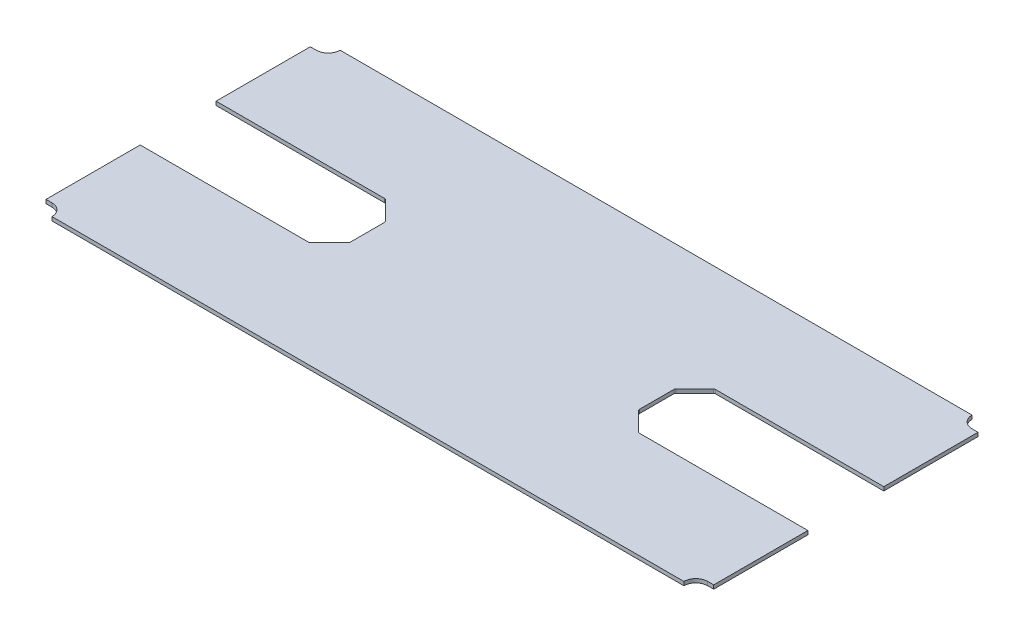
ISO-10303-21;
HEADER;
FILE_DESCRIPTION(('STEP AP214'),'2;1');
FILE_NAME('part.step','',(''),(''),'','','');
FILE_SCHEMA(('AUTOMOTIVE_DESIGN { 1 0 10303 214 1 1 1 1 }'));
ENDSEC;
DATA;
#1=APPLICATION_CONTEXT('core data for automotive mechanical design processes');
#2=APPLICATION_PROTOCOL_DEFINITION('international standard','automotive_design',2000,#1);
#3=PRODUCT_CONTEXT('',#1,'mechanical');
#4=PRODUCT('Part','Part','',(#3));
#5=PRODUCT_RELATED_PRODUCT_CATEGORY('part','',(#4));
#6=PRODUCT_DEFINITION_FORMATION('','',#4);
#7=PRODUCT_DEFINITION_CONTEXT('part definition',#1,'design');
#8=PRODUCT_DEFINITION('design','',#6,#7);
#9=PRODUCT_DEFINITION_SHAPE('','',#8);
#10=(LENGTH_UNIT() NAMED_UNIT(*) SI_UNIT(.MILLI.,.METRE.));
#11=(NAMED_UNIT(*) PLANE_ANGLE_UNIT() SI_UNIT($,.RADIAN.));
#12=(NAMED_UNIT(*) SI_UNIT($,.STERADIAN.) SOLID_ANGLE_UNIT());
#13=UNCERTAINTY_MEASURE_WITH_UNIT(LENGTH_MEASURE(1.E-05),#10,'distance_accuracy_value','');
#14=(GEOMETRIC_REPRESENTATION_CONTEXT(3) GLOBAL_UNCERTAINTY_ASSIGNED_CONTEXT((#13)) GLOBAL_UNIT_ASSIGNED_CONTEXT((#10,
#11,#12)) REPRESENTATION_CONTEXT('',''));
#15=CARTESIAN_POINT('',(0.,0.,0.));
#16=DIRECTION('',(0.,0.,1.));
#17=DIRECTION('',(1.,0.,0.));
#18=AXIS2_PLACEMENT_3D('',#15,#16,#17);
#19=CARTESIAN_POINT('',(825.,9.525,362.5));
#20=DIRECTION('',(0.,-1.,0.));
#21=DIRECTION('',(0.,0.,-1.));
#22=AXIS2_PLACEMENT_3D('',#19,#20,#21);
#23=CYLINDRICAL_SURFACE('',#22,30.);
#24=CARTESIAN_POINT('',(825.,0.,362.5));
#25=DIRECTION('',(0.,1.,0.));
#26=DIRECTION('',(0.,0.,1.));
#27=AXIS2_PLACEMENT_3D('',#24,#25,#26);
#28=CIRCLE('',#27,30.);
#29=CARTESIAN_POINT('',(825.,0.,332.5));
#30=VERTEX_POINT('',#29);
#31=CARTESIAN_POINT('',(795.,0.,362.5));
#32=VERTEX_POINT('',#31);
#33=EDGE_CURVE('E275',#30,#32,#28,.T.);
#34=ORIENTED_EDGE('',*,*,#33,.F.);
#35=DIRECTION('',(0.,-1.,0.));
#36=VECTOR('',#35,1.);
#37=CARTESIAN_POINT('',(825.,9.525,332.5));
#38=LINE('',#37,#36);
#39=CARTESIAN_POINT('',(825.,9.525,332.5));
#40=VERTEX_POINT('',#39);
#41=EDGE_CURVE('E271',#40,#30,#38,.T.);
#42=ORIENTED_EDGE('',*,*,#41,.F.);
#43=CARTESIAN_POINT('',(825.,9.525,362.5));
#44=DIRECTION('',(0.,1.,0.));
#45=DIRECTION('',(0.,0.,1.));
#46=AXIS2_PLACEMENT_3D('',#43,#44,#45);
#47=CIRCLE('',#46,30.);
#48=CARTESIAN_POINT('',(795.,9.525,362.5));
#49=VERTEX_POINT('',#48);
#50=EDGE_CURVE('E273',#40,#49,#47,.T.);
#51=ORIENTED_EDGE('',*,*,#50,.T.);
#52=DIRECTION('',(0.,-1.,0.));
#53=VECTOR('',#52,1.);
#54=CARTESIAN_POINT('',(795.,9.525,362.5));
#55=LINE('',#54,#53);
#56=EDGE_CURVE('E344',#49,#32,#55,.T.);
#57=ORIENTED_EDGE('',*,*,#56,.T.);
#58=EDGE_LOOP('',(#34,#42,#51,#57));
#59=FACE_BOUND('',#58,.T.);
#60=ADVANCED_FACE('F49',(#59),#23,.F.);
#61=CARTESIAN_POINT('',(0.,9.525,332.5));
#62=DIRECTION('',(0.,0.,1.));
#63=DIRECTION('',(1.,0.,0.));
#64=AXIS2_PLACEMENT_3D('',#61,#62,#63);
#65=PLANE('',#64);
#66=DIRECTION('',(-1.,0.,0.));
#67=VECTOR('',#66,1.);
#68=CARTESIAN_POINT('',(0.,0.,332.5));
#69=LINE('',#68,#67);
#70=CARTESIAN_POINT('',(840.,0.,332.5));
#71=VERTEX_POINT('',#70);
#72=EDGE_CURVE('E347',#71,#30,#69,.T.);
#73=ORIENTED_EDGE('',*,*,#72,.F.);
#74=DIRECTION('',(0.,-1.,0.));
#75=VECTOR('',#74,1.);
#76=CARTESIAN_POINT('',(840.,9.525,332.5));
#77=LINE('',#76,#75);
#78=CARTESIAN_POINT('',(840.,9.525,332.5));
#79=VERTEX_POINT('',#78);
#80=EDGE_CURVE('E282',#79,#71,#77,.T.);
#81=ORIENTED_EDGE('',*,*,#80,.F.);
#82=DIRECTION('',(-1.,0.,0.));
#83=VECTOR('',#82,1.);
#84=CARTESIAN_POINT('',(0.,9.525,332.5));
#85=LINE('',#84,#83);
#86=EDGE_CURVE('E288',#79,#40,#85,.T.);
#87=ORIENTED_EDGE('',*,*,#86,.T.);
#88=ORIENTED_EDGE('',*,*,#41,.T.);
#89=EDGE_LOOP('',(#73,#81,#87,#88));
#90=FACE_BOUND('',#89,.T.);
#91=ADVANCED_FACE('F296',(#90),#65,.T.);
#92=CARTESIAN_POINT('',(840.,9.525,0.));
#93=DIRECTION('',(1.,0.,0.));
#94=DIRECTION('',(0.,0.,-1.));
#95=AXIS2_PLACEMENT_3D('',#92,#93,#94);
#96=PLANE('',#95);
#97=DIRECTION('',(0.,0.,1.));
#98=VECTOR('',#97,1.);
#99=CARTESIAN_POINT('',(840.,0.,0.));
#100=LINE('',#99,#98);
#101=CARTESIAN_POINT('',(840.,0.,95.5));
#102=VERTEX_POINT('',#101);
#103=EDGE_CURVE('E350',#102,#71,#100,.T.);
#104=ORIENTED_EDGE('',*,*,#103,.F.);
#105=DIRECTION('',(0.,-1.,0.));
#106=VECTOR('',#105,1.);
#107=CARTESIAN_POINT('',(840.,9.525,95.5));
#108=LINE('',#107,#106);
#109=CARTESIAN_POINT('',(840.,9.525,95.5));
#110=VERTEX_POINT('',#109);
#111=EDGE_CURVE('E430',#110,#102,#108,.T.);
#112=ORIENTED_EDGE('',*,*,#111,.F.);
#113=DIRECTION('',(0.,0.,1.));
#114=VECTOR('',#113,1.);
#115=CARTESIAN_POINT('',(840.,9.525,0.));
#116=LINE('',#115,#114);
#117=EDGE_CURVE('E298',#110,#79,#116,.T.);
#118=ORIENTED_EDGE('',*,*,#117,.T.);
#119=ORIENTED_EDGE('',*,*,#80,.T.);
#120=EDGE_LOOP('',(#104,#112,#118,#119));
#121=FACE_BOUND('',#120,.T.);
#122=ADVANCED_FACE('F616',(#121),#96,.T.);
#123=CARTESIAN_POINT('',(0.,9.525,95.5));
#124=DIRECTION('',(0.,0.,-1.));
#125=DIRECTION('',(-1.,0.,0.));
#126=AXIS2_PLACEMENT_3D('',#123,#124,#125);
#127=PLANE('',#126);
#128=DIRECTION('',(1.,0.,0.));
#129=VECTOR('',#128,1.);
#130=CARTESIAN_POINT('',(0.,0.,95.5));
#131=LINE('',#130,#129);
#132=CARTESIAN_POINT('',(416.071067811866,0.,95.5));
#133=VERTEX_POINT('',#132);
#134=EDGE_CURVE('E354',#133,#102,#131,.T.);
#135=ORIENTED_EDGE('',*,*,#134,.F.);
#136=DIRECTION('',(0.,-1.,0.));
#137=VECTOR('',#136,1.);
#138=CARTESIAN_POINT('',(416.071067811866,9.525,95.5));
#139=LINE('',#138,#137);
#140=CARTESIAN_POINT('',(416.071067811866,9.525,95.5));
#141=VERTEX_POINT('',#140);
#142=EDGE_CURVE('E474',#133,#141,#139,.F.);
#143=ORIENTED_EDGE('',*,*,#142,.T.);
#144=DIRECTION('',(1.,0.,0.));
#145=VECTOR('',#144,1.);
#146=CARTESIAN_POINT('',(0.,9.525,95.5));
#147=LINE('',#146,#145);
#148=EDGE_CURVE('E301',#141,#110,#147,.T.);
#149=ORIENTED_EDGE('',*,*,#148,.T.);
#150=ORIENTED_EDGE('',*,*,#111,.T.);
#151=EDGE_LOOP('',(#135,#143,#149,#150));
#152=FACE_BOUND('',#151,.T.);
#153=ADVANCED_FACE('F611',(#152),#127,.T.);
#154=CARTESIAN_POINT('',(364.,9.525,0.));
#155=DIRECTION('',(1.,0.,0.));
#156=DIRECTION('',(0.,0.,-1.));
#157=AXIS2_PLACEMENT_3D('',#154,#155,#156);
#158=PLANE('',#157);
#159=DIRECTION('',(0.,0.,1.));
#160=VECTOR('',#159,1.);
#161=CARTESIAN_POINT('',(364.,0.,0.));
#162=LINE('',#161,#160);
#163=CARTESIAN_POINT('',(364.,0.,-43.4289321881347));
#164=VERTEX_POINT('',#163);
#165=CARTESIAN_POINT('',(364.,0.,43.4289321881341));
#166=VERTEX_POINT('',#165);
#167=EDGE_CURVE('E358',#164,#166,#162,.T.);
#168=ORIENTED_EDGE('',*,*,#167,.F.);
#169=DIRECTION('',(0.,-1.,0.));
#170=VECTOR('',#169,1.);
#171=CARTESIAN_POINT('',(364.,9.525,-43.4289321881347));
#172=LINE('',#171,#170);
#173=CARTESIAN_POINT('',(364.,9.525,-43.4289321881347));
#174=VERTEX_POINT('',#173);
#175=EDGE_CURVE('E463',#164,#174,#172,.F.);
#176=ORIENTED_EDGE('',*,*,#175,.T.);
#177=DIRECTION('',(0.,0.,1.));
#178=VECTOR('',#177,1.);
#179=CARTESIAN_POINT('',(364.,9.525,0.));
#180=LINE('',#179,#178);
#181=CARTESIAN_POINT('',(364.,9.525,43.4289321881341));
#182=VERTEX_POINT('',#181);
#183=EDGE_CURVE('E307',#174,#182,#180,.T.);
#184=ORIENTED_EDGE('',*,*,#183,.T.);
#185=DIRECTION('',(0.,1.,0.));
#186=VECTOR('',#185,1.);
#187=CARTESIAN_POINT('',(364.,9.525,43.4289321881341));
#188=LINE('',#187,#186);
#189=EDGE_CURVE('E460',#182,#166,#188,.F.);
#190=ORIENTED_EDGE('',*,*,#189,.T.);
#191=EDGE_LOOP('',(#168,#176,#184,#190));
#192=FACE_BOUND('',#191,.T.);
#193=ADVANCED_FACE('F594',(#192),#158,.T.);
#194=CARTESIAN_POINT('',(0.,9.525,-95.5));
#195=DIRECTION('',(0.,0.,1.));
#196=DIRECTION('',(1.,0.,0.));
#197=AXIS2_PLACEMENT_3D('',#194,#195,#196);
#198=PLANE('',#197);
#199=DIRECTION('',(-1.,0.,0.));
#200=VECTOR('',#199,1.);
#201=CARTESIAN_POINT('',(0.,9.525,-95.5));
#202=LINE('',#201,#200);
#203=CARTESIAN_POINT('',(840.,9.525,-95.5));
#204=VERTEX_POINT('',#203);
#205=CARTESIAN_POINT('',(416.071067811866,9.525,-95.5));
#206=VERTEX_POINT('',#205);
#207=EDGE_CURVE('E310',#204,#206,#202,.T.);
#208=ORIENTED_EDGE('',*,*,#207,.T.);
#209=DIRECTION('',(0.,1.,0.));
#210=VECTOR('',#209,1.);
#211=CARTESIAN_POINT('',(416.071067811866,9.525,-95.5));
#212=LINE('',#211,#210);
#213=CARTESIAN_POINT('',(416.071067811866,0.,-95.5));
#214=VERTEX_POINT('',#213);
#215=EDGE_CURVE('E477',#206,#214,#212,.F.);
#216=ORIENTED_EDGE('',*,*,#215,.T.);
#217=DIRECTION('',(-1.,0.,0.));
#218=VECTOR('',#217,1.);
#219=CARTESIAN_POINT('',(0.,0.,-95.5));
#220=LINE('',#219,#218);
#221=CARTESIAN_POINT('',(840.,0.,-95.5));
#222=VERTEX_POINT('',#221);
#223=EDGE_CURVE('E361',#222,#214,#220,.T.);
#224=ORIENTED_EDGE('',*,*,#223,.F.);
#225=DIRECTION('',(0.,-1.,0.));
#226=VECTOR('',#225,1.);
#227=CARTESIAN_POINT('',(840.,9.525,-95.5));
#228=LINE('',#227,#226);
#229=EDGE_CURVE('E427',#204,#222,#228,.T.);
#230=ORIENTED_EDGE('',*,*,#229,.F.);
#231=EDGE_LOOP('',(#208,#216,#224,#230));
#232=FACE_BOUND('',#231,.T.);
#233=ADVANCED_FACE('F576',(#232),#198,.T.);
#234=CARTESIAN_POINT('',(840.,0.,-332.5));
#235=VERTEX_POINT('',#234);
#236=EDGE_CURVE('E355',#235,#222,#100,.T.);
#237=ORIENTED_EDGE('',*,*,#236,.F.);
#238=DIRECTION('',(0.,-1.,0.));
#239=VECTOR('',#238,1.);
#240=CARTESIAN_POINT('',(840.,9.525,-332.5));
#241=LINE('',#240,#239);
#242=CARTESIAN_POINT('',(840.,9.525,-332.5));
#243=VERTEX_POINT('',#242);
#244=EDGE_CURVE('E425',#243,#235,#241,.T.);
#245=ORIENTED_EDGE('',*,*,#244,.F.);
#246=EDGE_CURVE('E303',#243,#204,#116,.T.);
#247=ORIENTED_EDGE('',*,*,#246,.T.);
#248=ORIENTED_EDGE('',*,*,#229,.T.);
#249=EDGE_LOOP('',(#237,#245,#247,#248));
#250=FACE_BOUND('',#249,.T.);
#251=ADVANCED_FACE('F570',(#250),#96,.T.);
#252=CARTESIAN_POINT('',(0.,9.525,-332.5));
#253=DIRECTION('',(0.,0.,1.));
#254=DIRECTION('',(1.,0.,0.));
#255=AXIS2_PLACEMENT_3D('',#252,#253,#254);
#256=PLANE('',#255);
#257=DIRECTION('',(-1.,0.,0.));
#258=VECTOR('',#257,1.);
#259=CARTESIAN_POINT('',(0.,0.,-332.5));
#260=LINE('',#259,#258);
#261=CARTESIAN_POINT('',(825.,0.,-332.5));
#262=VERTEX_POINT('',#261);
#263=EDGE_CURVE('E365',#235,#262,#260,.T.);
#264=ORIENTED_EDGE('',*,*,#263,.T.);
#265=DIRECTION('',(0.,-1.,0.));
#266=VECTOR('',#265,1.);
#267=CARTESIAN_POINT('',(825.,9.525,-332.5));
#268=LINE('',#267,#266);
#269=CARTESIAN_POINT('',(825.,9.525,-332.5));
#270=VERTEX_POINT('',#269);
#271=EDGE_CURVE('E422',#270,#262,#268,.T.);
#272=ORIENTED_EDGE('',*,*,#271,.F.);
#273=DIRECTION('',(-1.,0.,0.));
#274=VECTOR('',#273,1.);
#275=CARTESIAN_POINT('',(0.,9.525,-332.5));
#276=LINE('',#275,#274);
#277=EDGE_CURVE('E313',#243,#270,#276,.T.);
#278=ORIENTED_EDGE('',*,*,#277,.F.);
#279=ORIENTED_EDGE('',*,*,#244,.T.);
#280=EDGE_LOOP('',(#264,#272,#278,#279));
#281=FACE_BOUND('',#280,.T.);
#282=ADVANCED_FACE('F565',(#281),#256,.F.);
#283=CARTESIAN_POINT('',(825.,9.525,-362.5));
#284=DIRECTION('',(0.,-1.,0.));
#285=DIRECTION('',(0.,0.,-1.));
#286=AXIS2_PLACEMENT_3D('',#283,#284,#285);
#287=CYLINDRICAL_SURFACE('',#286,30.);
#288=CARTESIAN_POINT('',(825.,0.,-362.5));
#289=DIRECTION('',(0.,1.,0.));
#290=DIRECTION('',(0.,0.,1.));
#291=AXIS2_PLACEMENT_3D('',#288,#289,#290);
#292=CIRCLE('',#291,30.);
#293=CARTESIAN_POINT('',(795.,0.,-362.5));
#294=VERTEX_POINT('',#293);
#295=EDGE_CURVE('E367',#262,#294,#292,.F.);
#296=ORIENTED_EDGE('',*,*,#295,.T.);
#297=DIRECTION('',(0.,-1.,0.));
#298=VECTOR('',#297,1.);
#299=CARTESIAN_POINT('',(795.,9.525,-362.5));
#300=LINE('',#299,#298);
#301=CARTESIAN_POINT('',(795.,9.525,-362.5));
#302=VERTEX_POINT('',#301);
#303=EDGE_CURVE('E420',#302,#294,#300,.T.);
#304=ORIENTED_EDGE('',*,*,#303,.F.);
#305=CARTESIAN_POINT('',(825.,9.525,-362.5));
#306=DIRECTION('',(0.,1.,0.));
#307=DIRECTION('',(0.,0.,1.));
#308=AXIS2_PLACEMENT_3D('',#305,#306,#307);
#309=CIRCLE('',#308,30.);
#310=EDGE_CURVE('E315',#270,#302,#309,.F.);
#311=ORIENTED_EDGE('',*,*,#310,.F.);
#312=ORIENTED_EDGE('',*,*,#271,.T.);
#313=EDGE_LOOP('',(#296,#304,#311,#312));
#314=FACE_BOUND('',#313,.T.);
#315=ADVANCED_FACE('F561',(#314),#287,.F.);
#316=CARTESIAN_POINT('',(0.,9.525,-362.5));
#317=DIRECTION('',(0.,0.,-1.));
#318=DIRECTION('',(-1.,0.,0.));
#319=AXIS2_PLACEMENT_3D('',#316,#317,#318);
#320=PLANE('',#319);
#321=DIRECTION('',(1.,0.,0.));
#322=VECTOR('',#321,1.);
#323=CARTESIAN_POINT('',(0.,0.,-362.5));
#324=LINE('',#323,#322);
#325=CARTESIAN_POINT('',(-795.,0.,-362.5));
#326=VERTEX_POINT('',#325);
#327=EDGE_CURVE('E370',#326,#294,#324,.T.);
#328=ORIENTED_EDGE('',*,*,#327,.F.);
#329=DIRECTION('',(0.,-1.,0.));
#330=VECTOR('',#329,1.);
#331=CARTESIAN_POINT('',(-795.,9.525,-362.5));
#332=LINE('',#331,#330);
#333=CARTESIAN_POINT('',(-795.,9.525,-362.5));
#334=VERTEX_POINT('',#333);
#335=EDGE_CURVE('E418',#334,#326,#332,.T.);
#336=ORIENTED_EDGE('',*,*,#335,.F.);
#337=DIRECTION('',(1.,0.,0.));
#338=VECTOR('',#337,1.);
#339=CARTESIAN_POINT('',(0.,9.525,-362.5));
#340=LINE('',#339,#338);
#341=EDGE_CURVE('E317',#334,#302,#340,.T.);
#342=ORIENTED_EDGE('',*,*,#341,.T.);
#343=ORIENTED_EDGE('',*,*,#303,.T.);
#344=EDGE_LOOP('',(#328,#336,#342,#343));
#345=FACE_BOUND('',#344,.T.);
#346=ADVANCED_FACE('F556',(#345),#320,.T.);
#347=CARTESIAN_POINT('',(-825.,9.525,-362.5));
#348=DIRECTION('',(0.,-1.,0.));
#349=DIRECTION('',(0.,0.,-1.));
#350=AXIS2_PLACEMENT_3D('',#347,#348,#349);
#351=CYLINDRICAL_SURFACE('',#350,30.);
#352=CARTESIAN_POINT('',(-825.,0.,-362.5));
#353=DIRECTION('',(0.,1.,0.));
#354=DIRECTION('',(0.,0.,1.));
#355=AXIS2_PLACEMENT_3D('',#352,#353,#354);
#356=CIRCLE('',#355,30.);
#357=CARTESIAN_POINT('',(-825.,0.,-332.5));
#358=VERTEX_POINT('',#357);
#359=EDGE_CURVE('E373',#358,#326,#356,.T.);
#360=ORIENTED_EDGE('',*,*,#359,.F.);
#361=DIRECTION('',(0.,-1.,0.));
#362=VECTOR('',#361,1.);
#363=CARTESIAN_POINT('',(-825.,9.525,-332.5));
#364=LINE('',#363,#362);
#365=CARTESIAN_POINT('',(-825.,9.525,-332.5));
#366=VERTEX_POINT('',#365);
#367=EDGE_CURVE('E416',#366,#358,#364,.T.);
#368=ORIENTED_EDGE('',*,*,#367,.F.);
#369=CARTESIAN_POINT('',(-825.,9.525,-362.5));
#370=DIRECTION('',(0.,1.,0.));
#371=DIRECTION('',(0.,0.,1.));
#372=AXIS2_PLACEMENT_3D('',#369,#370,#371);
#373=CIRCLE('',#372,30.);
#374=EDGE_CURVE('E320',#366,#334,#373,.T.);
#375=ORIENTED_EDGE('',*,*,#374,.T.);
#376=ORIENTED_EDGE('',*,*,#335,.T.);
#377=EDGE_LOOP('',(#360,#368,#375,#376));
#378=FACE_BOUND('',#377,.T.);
#379=ADVANCED_FACE('F551',(#378),#351,.F.);
#380=CARTESIAN_POINT('',(0.,9.525,-332.5));
#381=DIRECTION('',(0.,0.,-1.));
#382=DIRECTION('',(-1.,0.,0.));
#383=AXIS2_PLACEMENT_3D('',#380,#381,#382);
#384=PLANE('',#383);
#385=DIRECTION('',(1.,0.,0.));
#386=VECTOR('',#385,1.);
#387=CARTESIAN_POINT('',(0.,0.,-332.5));
#388=LINE('',#387,#386);
#389=CARTESIAN_POINT('',(-840.,0.,-332.5));
#390=VERTEX_POINT('',#389);
#391=EDGE_CURVE('E376',#390,#358,#388,.T.);
#392=ORIENTED_EDGE('',*,*,#391,.F.);
#393=DIRECTION('',(0.,-1.,0.));
#394=VECTOR('',#393,1.);
#395=CARTESIAN_POINT('',(-840.,9.525,-332.5));
#396=LINE('',#395,#394);
#397=CARTESIAN_POINT('',(-840.,9.525,-332.5));
#398=VERTEX_POINT('',#397);
#399=EDGE_CURVE('E414',#398,#390,#396,.T.);
#400=ORIENTED_EDGE('',*,*,#399,.F.);
#401=DIRECTION('',(1.,0.,0.));
#402=VECTOR('',#401,1.);
#403=CARTESIAN_POINT('',(0.,9.525,-332.5));
#404=LINE('',#403,#402);
#405=EDGE_CURVE('E323',#398,#366,#404,.T.);
#406=ORIENTED_EDGE('',*,*,#405,.T.);
#407=ORIENTED_EDGE('',*,*,#367,.T.);
#408=EDGE_LOOP('',(#392,#400,#406,#407));
#409=FACE_BOUND('',#408,.T.);
#410=ADVANCED_FACE('F545',(#409),#384,.T.);
#411=CARTESIAN_POINT('',(-840.,9.525,0.));
#412=DIRECTION('',(1.,0.,0.));
#413=DIRECTION('',(0.,0.,-1.));
#414=AXIS2_PLACEMENT_3D('',#411,#412,#413);
#415=PLANE('',#414);
#416=DIRECTION('',(0.,0.,1.));
#417=VECTOR('',#416,1.);
#418=CARTESIAN_POINT('',(-840.,0.,0.));
#419=LINE('',#418,#417);
#420=CARTESIAN_POINT('',(-840.,0.,-95.5));
#421=VERTEX_POINT('',#420);
#422=EDGE_CURVE('E379',#390,#421,#419,.T.);
#423=ORIENTED_EDGE('',*,*,#422,.T.);
#424=DIRECTION('',(0.,-1.,0.));
#425=VECTOR('',#424,1.);
#426=CARTESIAN_POINT('',(-840.,9.525,-95.5));
#427=LINE('',#426,#425);
#428=CARTESIAN_POINT('',(-840.,9.525,-95.5));
#429=VERTEX_POINT('',#428);
#430=EDGE_CURVE('E411',#429,#421,#427,.T.);
#431=ORIENTED_EDGE('',*,*,#430,.F.);
#432=DIRECTION('',(0.,0.,1.));
#433=VECTOR('',#432,1.);
#434=CARTESIAN_POINT('',(-840.,9.525,0.));
#435=LINE('',#434,#433);
#436=EDGE_CURVE('E326',#398,#429,#435,.T.);
#437=ORIENTED_EDGE('',*,*,#436,.F.);
#438=ORIENTED_EDGE('',*,*,#399,.T.);
#439=EDGE_LOOP('',(#423,#431,#437,#438));
#440=FACE_BOUND('',#439,.T.);
#441=ADVANCED_FACE('F829',(#440),#415,.F.);
#442=CARTESIAN_POINT('',(0.,9.525,-95.5));
#443=DIRECTION('',(0.,0.,-1.));
#444=DIRECTION('',(-1.,0.,0.));
#445=AXIS2_PLACEMENT_3D('',#442,#443,#444);
#446=PLANE('',#445);
#447=DIRECTION('',(1.,0.,0.));
#448=VECTOR('',#447,1.);
#449=CARTESIAN_POINT('',(0.,0.,-95.5));
#450=LINE('',#449,#448);
#451=CARTESIAN_POINT('',(-416.071067811866,0.,-95.5));
#452=VERTEX_POINT('',#451);
#453=EDGE_CURVE('E381',#421,#452,#450,.T.);
#454=ORIENTED_EDGE('',*,*,#453,.T.);
#455=DIRECTION('',(0.,-1.,0.));
#456=VECTOR('',#455,1.);
#457=CARTESIAN_POINT('',(-416.071067811866,9.525,-95.5));
#458=LINE('',#457,#456);
#459=CARTESIAN_POINT('',(-416.071067811866,9.525,-95.5));
#460=VERTEX_POINT('',#459);
#461=EDGE_CURVE('E499',#452,#460,#458,.F.);
#462=ORIENTED_EDGE('',*,*,#461,.T.);
#463=DIRECTION('',(1.,0.,0.));
#464=VECTOR('',#463,1.);
#465=CARTESIAN_POINT('',(0.,9.525,-95.5));
#466=LINE('',#465,#464);
#467=EDGE_CURVE('E328',#429,#460,#466,.T.);
#468=ORIENTED_EDGE('',*,*,#467,.F.);
#469=ORIENTED_EDGE('',*,*,#430,.T.);
#470=EDGE_LOOP('',(#454,#462,#468,#469));
#471=FACE_BOUND('',#470,.T.);
#472=ADVANCED_FACE('F538',(#471),#446,.F.);
#473=CARTESIAN_POINT('',(-364.,9.525,0.));
#474=DIRECTION('',(1.,0.,0.));
#475=DIRECTION('',(0.,0.,-1.));
#476=AXIS2_PLACEMENT_3D('',#473,#474,#475);
#477=PLANE('',#476);
#478=DIRECTION('',(0.,0.,1.));
#479=VECTOR('',#478,1.);
#480=CARTESIAN_POINT('',(-364.,0.,0.));
#481=LINE('',#480,#479);
#482=CARTESIAN_POINT('',(-364.,0.,-43.4289321881341));
#483=VERTEX_POINT('',#482);
#484=CARTESIAN_POINT('',(-364.,0.,43.4289321881347));
#485=VERTEX_POINT('',#484);
#486=EDGE_CURVE('E384',#483,#485,#481,.T.);
#487=ORIENTED_EDGE('',*,*,#486,.T.);
#488=DIRECTION('',(0.,-1.,0.));
#489=VECTOR('',#488,1.);
#490=CARTESIAN_POINT('',(-364.,9.525,43.4289321881347));
#491=LINE('',#490,#489);
#492=CARTESIAN_POINT('',(-364.,9.525,43.4289321881347));
#493=VERTEX_POINT('',#492);
#494=EDGE_CURVE('E492',#485,#493,#491,.F.);
#495=ORIENTED_EDGE('',*,*,#494,.T.);
#496=DIRECTION('',(0.,0.,1.));
#497=VECTOR('',#496,1.);
#498=CARTESIAN_POINT('',(-364.,9.525,0.));
#499=LINE('',#498,#497);
#500=CARTESIAN_POINT('',(-364.,9.525,-43.4289321881341));
#501=VERTEX_POINT('',#500);
#502=EDGE_CURVE('E332',#501,#493,#499,.T.);
#503=ORIENTED_EDGE('',*,*,#502,.F.);
#504=DIRECTION('',(0.,1.,0.));
#505=VECTOR('',#504,1.);
#506=CARTESIAN_POINT('',(-364.,0.,-43.4289321881341));
#507=LINE('',#506,#505);
#508=EDGE_CURVE('E489',#501,#483,#507,.F.);
#509=ORIENTED_EDGE('',*,*,#508,.T.);
#510=EDGE_LOOP('',(#487,#495,#503,#509));
#511=FACE_BOUND('',#510,.T.);
#512=ADVANCED_FACE('F656',(#511),#477,.F.);
#513=CARTESIAN_POINT('',(0.,9.525,95.5));
#514=DIRECTION('',(0.,0.,1.));
#515=DIRECTION('',(1.,0.,0.));
#516=AXIS2_PLACEMENT_3D('',#513,#514,#515);
#517=PLANE('',#516);
#518=DIRECTION('',(-1.,0.,0.));
#519=VECTOR('',#518,1.);
#520=CARTESIAN_POINT('',(0.,9.525,95.5));
#521=LINE('',#520,#519);
#522=CARTESIAN_POINT('',(-416.071067811866,9.525,95.5));
#523=VERTEX_POINT('',#522);
#524=CARTESIAN_POINT('',(-840.,9.525,95.5));
#525=VERTEX_POINT('',#524);
#526=EDGE_CURVE('E335',#523,#525,#521,.T.);
#527=ORIENTED_EDGE('',*,*,#526,.F.);
#528=DIRECTION('',(0.,1.,0.));
#529=VECTOR('',#528,1.);
#530=CARTESIAN_POINT('',(-416.071067811866,0.,95.5));
#531=LINE('',#530,#529);
#532=CARTESIAN_POINT('',(-416.071067811866,0.,95.5));
#533=VERTEX_POINT('',#532);
#534=EDGE_CURVE('E480',#523,#533,#531,.F.);
#535=ORIENTED_EDGE('',*,*,#534,.T.);
#536=DIRECTION('',(-1.,0.,0.));
#537=VECTOR('',#536,1.);
#538=CARTESIAN_POINT('',(0.,0.,95.5));
#539=LINE('',#538,#537);
#540=CARTESIAN_POINT('',(-840.,0.,95.5));
#541=VERTEX_POINT('',#540);
#542=EDGE_CURVE('E387',#533,#541,#539,.T.);
#543=ORIENTED_EDGE('',*,*,#542,.T.);
#544=DIRECTION('',(0.,-1.,0.));
#545=VECTOR('',#544,1.);
#546=CARTESIAN_POINT('',(-840.,9.525,95.5));
#547=LINE('',#546,#545);
#548=EDGE_CURVE('E408',#525,#541,#547,.T.);
#549=ORIENTED_EDGE('',*,*,#548,.F.);
#550=EDGE_LOOP('',(#527,#535,#543,#549));
#551=FACE_BOUND('',#550,.T.);
#552=ADVANCED_FACE('F639',(#551),#517,.F.);
#553=CARTESIAN_POINT('',(-840.,0.,332.5));
#554=VERTEX_POINT('',#553);
#555=EDGE_CURVE('E382',#541,#554,#419,.T.);
#556=ORIENTED_EDGE('',*,*,#555,.T.);
#557=DIRECTION('',(0.,-1.,0.));
#558=VECTOR('',#557,1.);
#559=CARTESIAN_POINT('',(-840.,9.525,332.5));
#560=LINE('',#559,#558);
#561=CARTESIAN_POINT('',(-840.,9.525,332.5));
#562=VERTEX_POINT('',#561);
#563=EDGE_CURVE('E405',#562,#554,#560,.T.);
#564=ORIENTED_EDGE('',*,*,#563,.F.);
#565=EDGE_CURVE('E329',#525,#562,#435,.T.);
#566=ORIENTED_EDGE('',*,*,#565,.F.);
#567=ORIENTED_EDGE('',*,*,#548,.T.);
#568=EDGE_LOOP('',(#556,#564,#566,#567));
#569=FACE_BOUND('',#568,.T.);
#570=ADVANCED_FACE('F634',(#569),#415,.F.);
#571=CARTESIAN_POINT('',(0.,9.525,332.5));
#572=DIRECTION('',(0.,0.,-1.));
#573=DIRECTION('',(-1.,0.,0.));
#574=AXIS2_PLACEMENT_3D('',#571,#572,#573);
#575=PLANE('',#574);
#576=DIRECTION('',(1.,0.,0.));
#577=VECTOR('',#576,1.);
#578=CARTESIAN_POINT('',(0.,0.,332.5));
#579=LINE('',#578,#577);
#580=CARTESIAN_POINT('',(-825.,0.,332.5));
#581=VERTEX_POINT('',#580);
#582=EDGE_CURVE('E390',#554,#581,#579,.T.);
#583=ORIENTED_EDGE('',*,*,#582,.T.);
#584=DIRECTION('',(0.,-1.,0.));
#585=VECTOR('',#584,1.);
#586=CARTESIAN_POINT('',(-825.,9.525,332.5));
#587=LINE('',#586,#585);
#588=CARTESIAN_POINT('',(-825.,9.525,332.5));
#589=VERTEX_POINT('',#588);
#590=EDGE_CURVE('E402',#589,#581,#587,.T.);
#591=ORIENTED_EDGE('',*,*,#590,.F.);
#592=DIRECTION('',(1.,0.,0.));
#593=VECTOR('',#592,1.);
#594=CARTESIAN_POINT('',(0.,9.525,332.5));
#595=LINE('',#594,#593);
#596=EDGE_CURVE('E338',#562,#589,#595,.T.);
#597=ORIENTED_EDGE('',*,*,#596,.F.);
#598=ORIENTED_EDGE('',*,*,#563,.T.);
#599=EDGE_LOOP('',(#583,#591,#597,#598));
#600=FACE_BOUND('',#599,.T.);
#601=ADVANCED_FACE('F629',(#600),#575,.F.);
#602=CARTESIAN_POINT('',(-825.,9.525,362.5));
#603=DIRECTION('',(0.,-1.,0.));
#604=DIRECTION('',(0.,0.,-1.));
#605=AXIS2_PLACEMENT_3D('',#602,#603,#604);
#606=CYLINDRICAL_SURFACE('',#605,30.);
#607=CARTESIAN_POINT('',(-825.,0.,362.5));
#608=DIRECTION('',(0.,1.,0.));
#609=DIRECTION('',(0.,0.,1.));
#610=AXIS2_PLACEMENT_3D('',#607,#608,#609);
#611=CIRCLE('',#610,30.);
#612=CARTESIAN_POINT('',(-795.,0.,362.5));
#613=VERTEX_POINT('',#612);
#614=EDGE_CURVE('E392',#581,#613,#611,.F.);
#615=ORIENTED_EDGE('',*,*,#614,.T.);
#616=DIRECTION('',(0.,-1.,0.));
#617=VECTOR('',#616,1.);
#618=CARTESIAN_POINT('',(-795.,9.525,362.5));
#619=LINE('',#618,#617);
#620=CARTESIAN_POINT('',(-795.,9.525,362.5));
#621=VERTEX_POINT('',#620);
#622=EDGE_CURVE('E399',#621,#613,#619,.T.);
#623=ORIENTED_EDGE('',*,*,#622,.F.);
#624=CARTESIAN_POINT('',(-825.,9.525,362.5));
#625=DIRECTION('',(0.,1.,0.));
#626=DIRECTION('',(0.,0.,1.));
#627=AXIS2_PLACEMENT_3D('',#624,#625,#626);
#628=CIRCLE('',#627,30.);
#629=EDGE_CURVE('E340',#589,#621,#628,.F.);
#630=ORIENTED_EDGE('',*,*,#629,.F.);
#631=ORIENTED_EDGE('',*,*,#590,.T.);
#632=EDGE_LOOP('',(#615,#623,#630,#631));
#633=FACE_BOUND('',#632,.T.);
#634=ADVANCED_FACE('F625',(#633),#606,.F.);
#635=CARTESIAN_POINT('',(0.,9.525,362.5));
#636=DIRECTION('',(0.,0.,-1.));
#637=DIRECTION('',(-1.,0.,0.));
#638=AXIS2_PLACEMENT_3D('',#635,#636,#637);
#639=PLANE('',#638);
#640=DIRECTION('',(1.,0.,0.));
#641=VECTOR('',#640,1.);
#642=CARTESIAN_POINT('',(0.,0.,362.5));
#643=LINE('',#642,#641);
#644=EDGE_CURVE('E294',#613,#32,#643,.T.);
#645=ORIENTED_EDGE('',*,*,#644,.T.);
#646=ORIENTED_EDGE('',*,*,#56,.F.);
#647=DIRECTION('',(1.,0.,0.));
#648=VECTOR('',#647,1.);
#649=CARTESIAN_POINT('',(0.,9.525,362.5));
#650=LINE('',#649,#648);
#651=EDGE_CURVE('E291',#621,#49,#650,.T.);
#652=ORIENTED_EDGE('',*,*,#651,.F.);
#653=ORIENTED_EDGE('',*,*,#622,.T.);
#654=EDGE_LOOP('',(#645,#646,#652,#653));
#655=FACE_BOUND('',#654,.T.);
#656=ADVANCED_FACE('F621',(#655),#639,.F.);
#657=CARTESIAN_POINT('',(0.,9.525,0.));
#658=DIRECTION('',(0.,1.,0.));
#659=DIRECTION('',(0.,0.,1.));
#660=AXIS2_PLACEMENT_3D('',#657,#658,#659);
#661=PLANE('',#660);
#662=ORIENTED_EDGE('',*,*,#50,.F.);
#663=ORIENTED_EDGE('',*,*,#86,.F.);
#664=ORIENTED_EDGE('',*,*,#117,.F.);
#665=ORIENTED_EDGE('',*,*,#148,.F.);
#666=CARTESIAN_POINT('',(416.071067811866,9.525,90.5));
#667=DIRECTION('',(0.,1.,0.));
#668=DIRECTION('',(0.,0.,1.));
#669=AXIS2_PLACEMENT_3D('',#666,#667,#668);
#670=CIRCLE('',#669,5.);
#671=CARTESIAN_POINT('',(412.535533905933,9.525,94.0355339059327));
#672=VERTEX_POINT('',#671);
#673=EDGE_CURVE('E509',#141,#672,#670,.F.);
#674=ORIENTED_EDGE('',*,*,#673,.T.);
#675=DIRECTION('',(0.707106781186545,0.,0.707106781186551));
#676=VECTOR('',#675,1.);
#677=CARTESIAN_POINT('',(364.,9.525,45.4999999999995));
#678=LINE('',#677,#676);
#679=CARTESIAN_POINT('',(365.464466094067,9.525,46.9644660940668));
#680=VERTEX_POINT('',#679);
#681=EDGE_CURVE('E438',#672,#680,#678,.F.);
#682=ORIENTED_EDGE('',*,*,#681,.T.);
#683=CARTESIAN_POINT('',(369.,9.525,43.4289321881341));
#684=DIRECTION('',(0.,1.,0.));
#685=DIRECTION('',(0.,0.,1.));
#686=AXIS2_PLACEMENT_3D('',#683,#684,#685);
#687=CIRCLE('',#686,5.);
#688=EDGE_CURVE('E507',#680,#182,#687,.F.);
#689=ORIENTED_EDGE('',*,*,#688,.T.);
#690=ORIENTED_EDGE('',*,*,#183,.F.);
#691=CARTESIAN_POINT('',(369.,9.525,-43.4289321881347));
#692=DIRECTION('',(0.,1.,0.));
#693=DIRECTION('',(0.,0.,1.));
#694=AXIS2_PLACEMENT_3D('',#691,#692,#693);
#695=CIRCLE('',#694,5.);
#696=CARTESIAN_POINT('',(365.464466094067,9.525,-46.9644660940675));
#697=VERTEX_POINT('',#696);
#698=EDGE_CURVE('E501',#174,#697,#695,.F.);
#699=ORIENTED_EDGE('',*,*,#698,.T.);
#700=DIRECTION('',(-0.707106781186551,0.,0.707106781186544));
#701=VECTOR('',#700,1.);
#702=CARTESIAN_POINT('',(414.,9.525,-95.5));
#703=LINE('',#702,#701);
#704=CARTESIAN_POINT('',(412.535533905933,9.525,-94.0355339059328));
#705=VERTEX_POINT('',#704);
#706=EDGE_CURVE('E444',#697,#705,#703,.F.);
#707=ORIENTED_EDGE('',*,*,#706,.T.);
#708=CARTESIAN_POINT('',(416.071067811866,9.525,-90.5));
#709=DIRECTION('',(0.,1.,0.));
#710=DIRECTION('',(0.,0.,1.));
#711=AXIS2_PLACEMENT_3D('',#708,#709,#710);
#712=CIRCLE('',#711,5.);
#713=EDGE_CURVE('E515',#705,#206,#712,.F.);
#714=ORIENTED_EDGE('',*,*,#713,.T.);
#715=ORIENTED_EDGE('',*,*,#207,.F.);
#716=ORIENTED_EDGE('',*,*,#246,.F.);
#717=ORIENTED_EDGE('',*,*,#277,.T.);
#718=ORIENTED_EDGE('',*,*,#310,.T.);
#719=ORIENTED_EDGE('',*,*,#341,.F.);
#720=ORIENTED_EDGE('',*,*,#374,.F.);
#721=ORIENTED_EDGE('',*,*,#405,.F.);
#722=ORIENTED_EDGE('',*,*,#436,.T.);
#723=ORIENTED_EDGE('',*,*,#467,.T.);
#724=CARTESIAN_POINT('',(-416.071067811866,9.525,-90.5));
#725=DIRECTION('',(0.,1.,0.));
#726=DIRECTION('',(0.,0.,1.));
#727=AXIS2_PLACEMENT_3D('',#724,#725,#726);
#728=CIRCLE('',#727,5.);
#729=CARTESIAN_POINT('',(-412.535533905933,9.525,-94.0355339059327));
#730=VERTEX_POINT('',#729);
#731=EDGE_CURVE('E57',#460,#730,#728,.F.);
#732=ORIENTED_EDGE('',*,*,#731,.T.);
#733=DIRECTION('',(-0.707106781186545,0.,-0.707106781186551));
#734=VECTOR('',#733,1.);
#735=CARTESIAN_POINT('',(-364.,9.525,-45.4999999999995));
#736=LINE('',#735,#734);
#737=CARTESIAN_POINT('',(-365.464466094067,9.525,-46.9644660940668));
#738=VERTEX_POINT('',#737);
#739=EDGE_CURVE('E457',#730,#738,#736,.F.);
#740=ORIENTED_EDGE('',*,*,#739,.T.);
#741=CARTESIAN_POINT('',(-369.,9.525,-43.4289321881341));
#742=DIRECTION('',(0.,1.,0.));
#743=DIRECTION('',(0.,0.,1.));
#744=AXIS2_PLACEMENT_3D('',#741,#742,#743);
#745=CIRCLE('',#744,5.);
#746=EDGE_CURVE('E529',#738,#501,#745,.F.);
#747=ORIENTED_EDGE('',*,*,#746,.T.);
#748=ORIENTED_EDGE('',*,*,#502,.T.);
#749=CARTESIAN_POINT('',(-369.,9.525,43.4289321881347));
#750=DIRECTION('',(0.,1.,0.));
#751=DIRECTION('',(0.,0.,1.));
#752=AXIS2_PLACEMENT_3D('',#749,#750,#751);
#753=CIRCLE('',#752,5.);
#754=CARTESIAN_POINT('',(-365.464466094067,9.525,46.9644660940675));
#755=VERTEX_POINT('',#754);
#756=EDGE_CURVE('E523',#493,#755,#753,.F.);
#757=ORIENTED_EDGE('',*,*,#756,.T.);
#758=DIRECTION('',(0.707106781186551,0.,-0.707106781186544));
#759=VECTOR('',#758,1.);
#760=CARTESIAN_POINT('',(-414.,9.525,95.5));
#761=LINE('',#760,#759);
#762=CARTESIAN_POINT('',(-412.535533905933,9.525,94.0355339059328));
#763=VERTEX_POINT('',#762);
#764=EDGE_CURVE('E451',#755,#763,#761,.F.);
#765=ORIENTED_EDGE('',*,*,#764,.T.);
#766=CARTESIAN_POINT('',(-416.071067811866,9.525,90.5));
#767=DIRECTION('',(0.,1.,0.));
#768=DIRECTION('',(0.,0.,1.));
#769=AXIS2_PLACEMENT_3D('',#766,#767,#768);
#770=CIRCLE('',#769,5.);
#771=EDGE_CURVE('E520',#763,#523,#770,.F.);
#772=ORIENTED_EDGE('',*,*,#771,.T.);
#773=ORIENTED_EDGE('',*,*,#526,.T.);
#774=ORIENTED_EDGE('',*,*,#565,.T.);
#775=ORIENTED_EDGE('',*,*,#596,.T.);
#776=ORIENTED_EDGE('',*,*,#629,.T.);
#777=ORIENTED_EDGE('',*,*,#651,.T.);
#778=EDGE_LOOP('',(#662,#663,#664,#665,#674,#682,#689,#690,#699,#707,#714,#715,#716,#717,#718,
#719,#720,#721,#722,#723,#732,#740,#747,#748,#757,#765,#772,#773,#774,#775,#776,#777));
#779=FACE_BOUND('',#778,.T.);
#780=ADVANCED_FACE('F286',(#779),#661,.T.);
#781=CARTESIAN_POINT('',(0.,0.,0.));
#782=DIRECTION('',(0.,1.,0.));
#783=DIRECTION('',(0.,0.,1.));
#784=AXIS2_PLACEMENT_3D('',#781,#782,#783);
#785=PLANE('',#784);
#786=ORIENTED_EDGE('',*,*,#33,.T.);
#787=ORIENTED_EDGE('',*,*,#644,.F.);
#788=ORIENTED_EDGE('',*,*,#614,.F.);
#789=ORIENTED_EDGE('',*,*,#582,.F.);
#790=ORIENTED_EDGE('',*,*,#555,.F.);
#791=ORIENTED_EDGE('',*,*,#542,.F.);
#792=CARTESIAN_POINT('',(-416.071067811866,0.,90.5));
#793=DIRECTION('',(0.,1.,0.));
#794=DIRECTION('',(0.,0.,1.));
#795=AXIS2_PLACEMENT_3D('',#792,#793,#794);
#796=CIRCLE('',#795,5.);
#797=CARTESIAN_POINT('',(-412.535533905933,0.,94.0355339059328));
#798=VERTEX_POINT('',#797);
#799=EDGE_CURVE('E517',#533,#798,#796,.T.);
#800=ORIENTED_EDGE('',*,*,#799,.T.);
#801=DIRECTION('',(-0.707106781186551,0.,0.707106781186544));
#802=VECTOR('',#801,1.);
#803=CARTESIAN_POINT('',(-159.249999999998,0.,-159.25));
#804=LINE('',#803,#802);
#805=CARTESIAN_POINT('',(-365.464466094067,0.,46.9644660940676));
#806=VERTEX_POINT('',#805);
#807=EDGE_CURVE('E447',#798,#806,#804,.F.);
#808=ORIENTED_EDGE('',*,*,#807,.T.);
#809=CARTESIAN_POINT('',(-369.,0.,43.4289321881347));
#810=DIRECTION('',(0.,1.,0.));
#811=DIRECTION('',(0.,0.,1.));
#812=AXIS2_PLACEMENT_3D('',#809,#810,#811);
#813=CIRCLE('',#812,5.);
#814=EDGE_CURVE('E525',#806,#485,#813,.T.);
#815=ORIENTED_EDGE('',*,*,#814,.T.);
#816=ORIENTED_EDGE('',*,*,#486,.F.);
#817=CARTESIAN_POINT('',(-369.,0.,-43.4289321881341));
#818=DIRECTION('',(0.,1.,0.));
#819=DIRECTION('',(0.,0.,1.));
#820=AXIS2_PLACEMENT_3D('',#817,#818,#819);
#821=CIRCLE('',#820,5.);
#822=CARTESIAN_POINT('',(-365.464466094067,0.,-46.9644660940669));
#823=VERTEX_POINT('',#822);
#824=EDGE_CURVE('E527',#483,#823,#821,.T.);
#825=ORIENTED_EDGE('',*,*,#824,.T.);
#826=DIRECTION('',(0.707106781186545,0.,0.707106781186551));
#827=VECTOR('',#826,1.);
#828=CARTESIAN_POINT('',(-159.250000000002,0.,159.25));
#829=LINE('',#828,#827);
#830=CARTESIAN_POINT('',(-412.535533905933,0.,-94.0355339059328));
#831=VERTEX_POINT('',#830);
#832=EDGE_CURVE('E455',#823,#831,#829,.F.);
#833=ORIENTED_EDGE('',*,*,#832,.T.);
#834=CARTESIAN_POINT('',(-416.071067811866,0.,-90.5));
#835=DIRECTION('',(0.,1.,0.));
#836=DIRECTION('',(0.,0.,1.));
#837=AXIS2_PLACEMENT_3D('',#834,#835,#836);
#838=CIRCLE('',#837,5.);
#839=EDGE_CURVE('E11',#831,#452,#838,.T.);
#840=ORIENTED_EDGE('',*,*,#839,.T.);
#841=ORIENTED_EDGE('',*,*,#453,.F.);
#842=ORIENTED_EDGE('',*,*,#422,.F.);
#843=ORIENTED_EDGE('',*,*,#391,.T.);
#844=ORIENTED_EDGE('',*,*,#359,.T.);
#845=ORIENTED_EDGE('',*,*,#327,.T.);
#846=ORIENTED_EDGE('',*,*,#295,.F.);
#847=ORIENTED_EDGE('',*,*,#263,.F.);
#848=ORIENTED_EDGE('',*,*,#236,.T.);
#849=ORIENTED_EDGE('',*,*,#223,.T.);
#850=CARTESIAN_POINT('',(416.071067811866,0.,-90.5));
#851=DIRECTION('',(0.,1.,0.));
#852=DIRECTION('',(0.,0.,1.));
#853=AXIS2_PLACEMENT_3D('',#850,#851,#852);
#854=CIRCLE('',#853,5.);
#855=CARTESIAN_POINT('',(412.535533905933,0.,-94.0355339059328));
#856=VERTEX_POINT('',#855);
#857=EDGE_CURVE('E513',#214,#856,#854,.T.);
#858=ORIENTED_EDGE('',*,*,#857,.T.);
#859=DIRECTION('',(0.707106781186551,0.,-0.707106781186544));
#860=VECTOR('',#859,1.);
#861=CARTESIAN_POINT('',(159.249999999998,0.,159.25));
#862=LINE('',#861,#860);
#863=CARTESIAN_POINT('',(365.464466094067,0.,-46.9644660940676));
#864=VERTEX_POINT('',#863);
#865=EDGE_CURVE('E441',#856,#864,#862,.F.);
#866=ORIENTED_EDGE('',*,*,#865,.T.);
#867=CARTESIAN_POINT('',(369.,0.,-43.4289321881347));
#868=DIRECTION('',(0.,1.,0.));
#869=DIRECTION('',(0.,0.,1.));
#870=AXIS2_PLACEMENT_3D('',#867,#868,#869);
#871=CIRCLE('',#870,5.);
#872=EDGE_CURVE('E503',#864,#164,#871,.T.);
#873=ORIENTED_EDGE('',*,*,#872,.T.);
#874=ORIENTED_EDGE('',*,*,#167,.T.);
#875=CARTESIAN_POINT('',(369.,0.,43.4289321881341));
#876=DIRECTION('',(0.,1.,0.));
#877=DIRECTION('',(0.,0.,1.));
#878=AXIS2_PLACEMENT_3D('',#875,#876,#877);
#879=CIRCLE('',#878,5.);
#880=CARTESIAN_POINT('',(365.464466094067,0.,46.9644660940669));
#881=VERTEX_POINT('',#880);
#882=EDGE_CURVE('E505',#166,#881,#879,.T.);
#883=ORIENTED_EDGE('',*,*,#882,.T.);
#884=DIRECTION('',(-0.707106781186545,0.,-0.707106781186551));
#885=VECTOR('',#884,1.);
#886=CARTESIAN_POINT('',(159.250000000002,0.,-159.25));
#887=LINE('',#886,#885);
#888=CARTESIAN_POINT('',(412.535533905933,0.,94.0355339059328));
#889=VERTEX_POINT('',#888);
#890=EDGE_CURVE('E281',#881,#889,#887,.F.);
#891=ORIENTED_EDGE('',*,*,#890,.T.);
#892=CARTESIAN_POINT('',(416.071067811866,0.,90.5));
#893=DIRECTION('',(0.,1.,0.));
#894=DIRECTION('',(0.,0.,1.));
#895=AXIS2_PLACEMENT_3D('',#892,#893,#894);
#896=CIRCLE('',#895,5.);
#897=EDGE_CURVE('E511',#889,#133,#896,.T.);
#898=ORIENTED_EDGE('',*,*,#897,.T.);
#899=ORIENTED_EDGE('',*,*,#134,.T.);
#900=ORIENTED_EDGE('',*,*,#103,.T.);
#901=ORIENTED_EDGE('',*,*,#72,.T.);
#902=EDGE_LOOP('',(#786,#787,#788,#789,#790,#791,#800,#808,#815,#816,#825,#833,#840,#841,#842,
#843,#844,#845,#846,#847,#848,#849,#858,#866,#873,#874,#883,#891,#898,#899,#900,#901));
#903=FACE_BOUND('',#902,.T.);
#904=ADVANCED_FACE('F541',(#903),#785,.F.);
#905=CARTESIAN_POINT('',(364.,9.525,45.4999999999995));
#906=DIRECTION('',(0.707106781186551,0.,-0.707106781186545));
#907=DIRECTION('',(0.,1.,0.));
#908=AXIS2_PLACEMENT_3D('',#905,#906,#907);
#909=PLANE('',#908);
#910=ORIENTED_EDGE('',*,*,#890,.F.);
#911=DIRECTION('',(0.,-1.,0.));
#912=VECTOR('',#911,1.);
#913=CARTESIAN_POINT('',(365.464466094067,9.525,46.9644660940668));
#914=LINE('',#913,#912);
#915=EDGE_CURVE('E472',#881,#680,#914,.F.);
#916=ORIENTED_EDGE('',*,*,#915,.T.);
#917=ORIENTED_EDGE('',*,*,#681,.F.);
#918=DIRECTION('',(0.,1.,0.));
#919=VECTOR('',#918,1.);
#920=CARTESIAN_POINT('',(412.535533905933,9.525,94.0355339059327));
#921=LINE('',#920,#919);
#922=EDGE_CURVE('E470',#672,#889,#921,.F.);
#923=ORIENTED_EDGE('',*,*,#922,.T.);
#924=EDGE_LOOP('',(#910,#916,#917,#923));
#925=FACE_BOUND('',#924,.T.);
#926=ADVANCED_FACE('F603',(#925),#909,.T.);
#927=CARTESIAN_POINT('',(414.,9.525,-95.5));
#928=DIRECTION('',(0.707106781186544,0.,0.707106781186551));
#929=DIRECTION('',(0.,1.,0.));
#930=AXIS2_PLACEMENT_3D('',#927,#928,#929);
#931=PLANE('',#930);
#932=ORIENTED_EDGE('',*,*,#706,.F.);
#933=DIRECTION('',(0.,1.,0.));
#934=VECTOR('',#933,1.);
#935=CARTESIAN_POINT('',(365.464466094067,9.525,-46.9644660940675));
#936=LINE('',#935,#934);
#937=EDGE_CURVE('E468',#697,#864,#936,.F.);
#938=ORIENTED_EDGE('',*,*,#937,.T.);
#939=ORIENTED_EDGE('',*,*,#865,.F.);
#940=DIRECTION('',(0.,-1.,0.));
#941=VECTOR('',#940,1.);
#942=CARTESIAN_POINT('',(412.535533905933,9.525,-94.0355339059328));
#943=LINE('',#942,#941);
#944=EDGE_CURVE('E466',#856,#705,#943,.F.);
#945=ORIENTED_EDGE('',*,*,#944,.T.);
#946=EDGE_LOOP('',(#932,#938,#939,#945));
#947=FACE_BOUND('',#946,.T.);
#948=ADVANCED_FACE('F584',(#947),#931,.T.);
#949=CARTESIAN_POINT('',(-414.,9.525,95.5));
#950=DIRECTION('',(-0.707106781186544,0.,-0.707106781186551));
#951=DIRECTION('',(0.,1.,0.));
#952=AXIS2_PLACEMENT_3D('',#949,#950,#951);
#953=PLANE('',#952);
#954=ORIENTED_EDGE('',*,*,#807,.F.);
#955=DIRECTION('',(0.,-1.,0.));
#956=VECTOR('',#955,1.);
#957=CARTESIAN_POINT('',(-412.535533905933,9.525,94.0355339059328));
#958=LINE('',#957,#956);
#959=EDGE_CURVE('E486',#798,#763,#958,.F.);
#960=ORIENTED_EDGE('',*,*,#959,.T.);
#961=ORIENTED_EDGE('',*,*,#764,.F.);
#962=DIRECTION('',(0.,1.,0.));
#963=VECTOR('',#962,1.);
#964=CARTESIAN_POINT('',(-365.464466094067,0.,46.9644660940675));
#965=LINE('',#964,#963);
#966=EDGE_CURVE('E484',#755,#806,#965,.F.);
#967=ORIENTED_EDGE('',*,*,#966,.T.);
#968=EDGE_LOOP('',(#954,#960,#961,#967));
#969=FACE_BOUND('',#968,.T.);
#970=ADVANCED_FACE('F648',(#969),#953,.T.);
#971=CARTESIAN_POINT('',(-364.,9.525,-45.4999999999995));
#972=DIRECTION('',(-0.707106781186551,0.,0.707106781186545));
#973=DIRECTION('',(0.,1.,0.));
#974=AXIS2_PLACEMENT_3D('',#971,#972,#973);
#975=PLANE('',#974);
#976=ORIENTED_EDGE('',*,*,#832,.F.);
#977=DIRECTION('',(0.,-1.,0.));
#978=VECTOR('',#977,1.);
#979=CARTESIAN_POINT('',(-365.464466094067,9.525,-46.9644660940668));
#980=LINE('',#979,#978);
#981=EDGE_CURVE('E497',#823,#738,#980,.F.);
#982=ORIENTED_EDGE('',*,*,#981,.T.);
#983=ORIENTED_EDGE('',*,*,#739,.F.);
#984=DIRECTION('',(0.,1.,0.));
#985=VECTOR('',#984,1.);
#986=CARTESIAN_POINT('',(-412.535533905933,0.,-94.0355339059328));
#987=LINE('',#986,#985);
#988=EDGE_CURVE('E495',#730,#831,#987,.F.);
#989=ORIENTED_EDGE('',*,*,#988,.T.);
#990=EDGE_LOOP('',(#976,#982,#983,#989));
#991=FACE_BOUND('',#990,.T.);
#992=ADVANCED_FACE('F535',(#991),#975,.T.);
#993=CARTESIAN_POINT('',(369.,9.525,-43.4289321881347));
#994=DIRECTION('',(0.,-1.,0.));
#995=DIRECTION('',(0.,0.,-1.));
#996=AXIS2_PLACEMENT_3D('',#993,#994,#995);
#997=CYLINDRICAL_SURFACE('',#996,5.);
#998=ORIENTED_EDGE('',*,*,#872,.F.);
#999=ORIENTED_EDGE('',*,*,#937,.F.);
#1000=ORIENTED_EDGE('',*,*,#698,.F.);
#1001=ORIENTED_EDGE('',*,*,#175,.F.);
#1002=EDGE_LOOP('',(#998,#999,#1000,#1001));
#1003=FACE_BOUND('',#1002,.T.);
#1004=ADVANCED_FACE('F590',(#1003),#997,.F.);
#1005=CARTESIAN_POINT('',(369.,9.525,43.4289321881341));
#1006=DIRECTION('',(0.,1.,0.));
#1007=DIRECTION('',(0.,0.,1.));
#1008=AXIS2_PLACEMENT_3D('',#1005,#1006,#1007);
#1009=CYLINDRICAL_SURFACE('',#1008,5.);
#1010=ORIENTED_EDGE('',*,*,#688,.F.);
#1011=ORIENTED_EDGE('',*,*,#915,.F.);
#1012=ORIENTED_EDGE('',*,*,#882,.F.);
#1013=ORIENTED_EDGE('',*,*,#189,.F.);
#1014=EDGE_LOOP('',(#1010,#1011,#1012,#1013));
#1015=FACE_BOUND('',#1014,.T.);
#1016=ADVANCED_FACE('F598',(#1015),#1009,.F.);
#1017=CARTESIAN_POINT('',(416.071067811866,9.525,90.5));
#1018=DIRECTION('',(0.,-1.,0.));
#1019=DIRECTION('',(0.,0.,-1.));
#1020=AXIS2_PLACEMENT_3D('',#1017,#1018,#1019);
#1021=CYLINDRICAL_SURFACE('',#1020,5.);
#1022=ORIENTED_EDGE('',*,*,#897,.F.);
#1023=ORIENTED_EDGE('',*,*,#922,.F.);
#1024=ORIENTED_EDGE('',*,*,#673,.F.);
#1025=ORIENTED_EDGE('',*,*,#142,.F.);
#1026=EDGE_LOOP('',(#1022,#1023,#1024,#1025));
#1027=FACE_BOUND('',#1026,.T.);
#1028=ADVANCED_FACE('F607',(#1027),#1021,.F.);
#1029=CARTESIAN_POINT('',(416.071067811866,9.525,-90.5));
#1030=DIRECTION('',(0.,1.,0.));
#1031=DIRECTION('',(0.,0.,1.));
#1032=AXIS2_PLACEMENT_3D('',#1029,#1030,#1031);
#1033=CYLINDRICAL_SURFACE('',#1032,5.);
#1034=ORIENTED_EDGE('',*,*,#713,.F.);
#1035=ORIENTED_EDGE('',*,*,#944,.F.);
#1036=ORIENTED_EDGE('',*,*,#857,.F.);
#1037=ORIENTED_EDGE('',*,*,#215,.F.);
#1038=EDGE_LOOP('',(#1034,#1035,#1036,#1037));
#1039=FACE_BOUND('',#1038,.T.);
#1040=ADVANCED_FACE('F587',(#1039),#1033,.F.);
#1041=CARTESIAN_POINT('',(-416.071067811866,9.525,90.5));
#1042=DIRECTION('',(0.,-1.,0.));
#1043=DIRECTION('',(0.,0.,-1.));
#1044=AXIS2_PLACEMENT_3D('',#1041,#1042,#1043);
#1045=CYLINDRICAL_SURFACE('',#1044,5.);
#1046=ORIENTED_EDGE('',*,*,#771,.F.);
#1047=ORIENTED_EDGE('',*,*,#959,.F.);
#1048=ORIENTED_EDGE('',*,*,#799,.F.);
#1049=ORIENTED_EDGE('',*,*,#534,.F.);
#1050=EDGE_LOOP('',(#1046,#1047,#1048,#1049));
#1051=FACE_BOUND('',#1050,.T.);
#1052=ADVANCED_FACE('F643',(#1051),#1045,.F.);
#1053=CARTESIAN_POINT('',(-369.,9.525,43.4289321881347));
#1054=DIRECTION('',(0.,1.,0.));
#1055=DIRECTION('',(0.,0.,1.));
#1056=AXIS2_PLACEMENT_3D('',#1053,#1054,#1055);
#1057=CYLINDRICAL_SURFACE('',#1056,5.);
#1058=ORIENTED_EDGE('',*,*,#814,.F.);
#1059=ORIENTED_EDGE('',*,*,#966,.F.);
#1060=ORIENTED_EDGE('',*,*,#756,.F.);
#1061=ORIENTED_EDGE('',*,*,#494,.F.);
#1062=EDGE_LOOP('',(#1058,#1059,#1060,#1061));
#1063=FACE_BOUND('',#1062,.T.);
#1064=ADVANCED_FACE('F652',(#1063),#1057,.F.);
#1065=CARTESIAN_POINT('',(-369.,9.525,-43.4289321881341));
#1066=DIRECTION('',(0.,-1.,0.));
#1067=DIRECTION('',(0.,0.,-1.));
#1068=AXIS2_PLACEMENT_3D('',#1065,#1066,#1067);
#1069=CYLINDRICAL_SURFACE('',#1068,5.);
#1070=ORIENTED_EDGE('',*,*,#746,.F.);
#1071=ORIENTED_EDGE('',*,*,#981,.F.);
#1072=ORIENTED_EDGE('',*,*,#824,.F.);
#1073=ORIENTED_EDGE('',*,*,#508,.F.);
#1074=EDGE_LOOP('',(#1070,#1071,#1072,#1073));
#1075=FACE_BOUND('',#1074,.T.);
#1076=ADVANCED_FACE('F660',(#1075),#1069,.F.);
#1077=CARTESIAN_POINT('',(-416.071067811866,9.525,-90.5));
#1078=DIRECTION('',(0.,1.,0.));
#1079=DIRECTION('',(0.,0.,1.));
#1080=AXIS2_PLACEMENT_3D('',#1077,#1078,#1079);
#1081=CYLINDRICAL_SURFACE('',#1080,5.);
#1082=ORIENTED_EDGE('',*,*,#839,.F.);
#1083=ORIENTED_EDGE('',*,*,#988,.F.);
#1084=ORIENTED_EDGE('',*,*,#731,.F.);
#1085=ORIENTED_EDGE('',*,*,#461,.F.);
#1086=EDGE_LOOP('',(#1082,#1083,#1084,#1085));
#1087=FACE_BOUND('',#1086,.T.);
#1088=ADVANCED_FACE('F51',(#1087),#1081,.F.);
#1089=CLOSED_SHELL('',(#60,#91,#122,#153,#193,#233,#251,#282,#315,#346,#379,#410,#441,#472,#512,
#552,#570,#601,#634,#656,#780,#904,#926,#948,#970,#992,#1004,#1016,#1028,#1040,#1052,#1064,
#1076,#1088));
#1090=MANIFOLD_SOLID_BREP('B2',#1089);
#1091=ADVANCED_BREP_SHAPE_REPRESENTATION('',(#18,#1090),#14);
#1092=SHAPE_DEFINITION_REPRESENTATION(#9,#1091);
ENDSEC;
END-ISO-10303-21;
